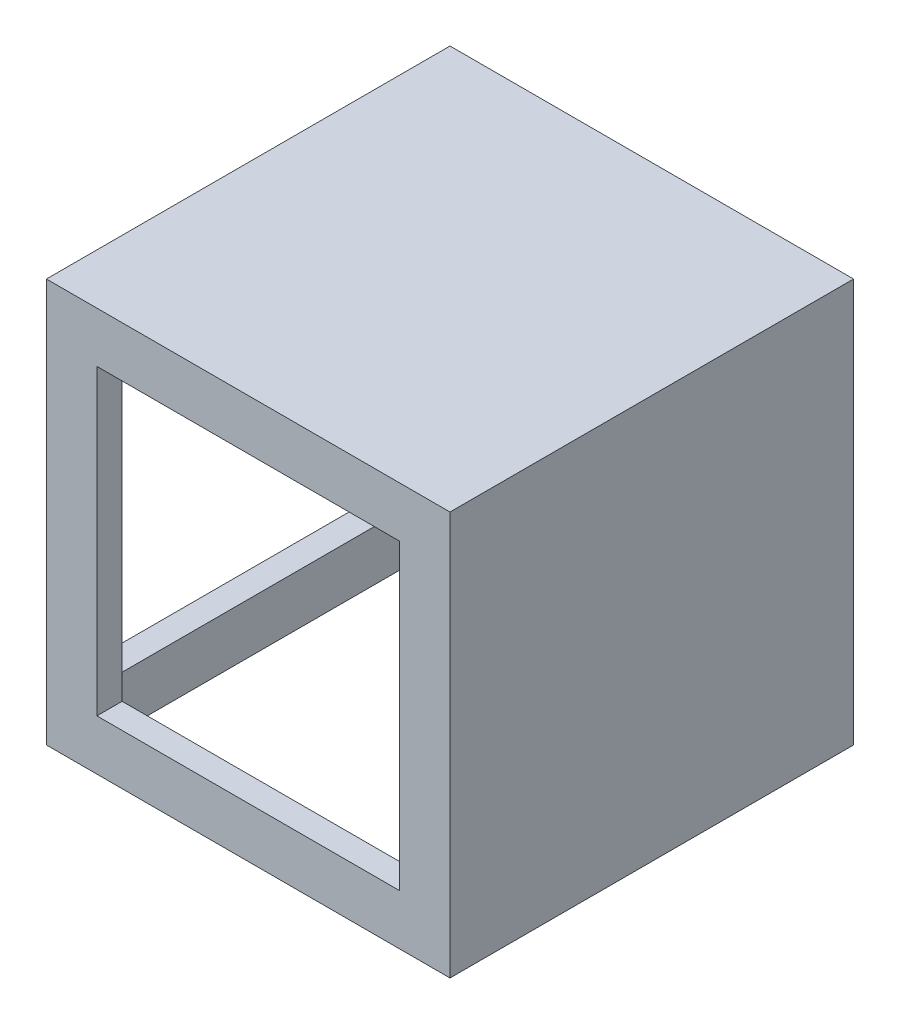
ISO-10303-21;
HEADER;
FILE_DESCRIPTION(('STEP AP214'),'2;1');
FILE_NAME('part.step','',(''),(''),'','','');
FILE_SCHEMA(('AUTOMOTIVE_DESIGN { 1 0 10303 214 1 1 1 1 }'));
ENDSEC;
DATA;
#1=APPLICATION_CONTEXT('core data for automotive mechanical design processes');
#2=APPLICATION_PROTOCOL_DEFINITION('international standard','automotive_design',2000,#1);
#3=PRODUCT_CONTEXT('',#1,'mechanical');
#4=PRODUCT('Part','Part','',(#3));
#5=PRODUCT_RELATED_PRODUCT_CATEGORY('part','',(#4));
#6=PRODUCT_DEFINITION_FORMATION('','',#4);
#7=PRODUCT_DEFINITION_CONTEXT('part definition',#1,'design');
#8=PRODUCT_DEFINITION('design','',#6,#7);
#9=PRODUCT_DEFINITION_SHAPE('','',#8);
#10=(LENGTH_UNIT() NAMED_UNIT(*) SI_UNIT(.MILLI.,.METRE.));
#11=(NAMED_UNIT(*) PLANE_ANGLE_UNIT() SI_UNIT($,.RADIAN.));
#12=(NAMED_UNIT(*) SI_UNIT($,.STERADIAN.) SOLID_ANGLE_UNIT());
#13=UNCERTAINTY_MEASURE_WITH_UNIT(LENGTH_MEASURE(1.E-05),#10,'distance_accuracy_value','');
#14=(GEOMETRIC_REPRESENTATION_CONTEXT(3) GLOBAL_UNCERTAINTY_ASSIGNED_CONTEXT((#13)) GLOBAL_UNIT_ASSIGNED_CONTEXT((#10,
#11,#12)) REPRESENTATION_CONTEXT('',''));
#15=CARTESIAN_POINT('',(0.,0.,0.));
#16=DIRECTION('',(0.,0.,1.));
#17=DIRECTION('',(1.,0.,0.));
#18=AXIS2_PLACEMENT_3D('',#15,#16,#17);
#19=CARTESIAN_POINT('',(16.,0.,16.));
#20=DIRECTION('',(0.,1.,0.));
#21=DIRECTION('',(0.,0.,1.));
#22=AXIS2_PLACEMENT_3D('',#19,#20,#21);
#23=PLANE('',#22);
#24=DIRECTION('',(1.,0.,0.));
#25=VECTOR('',#24,1.);
#26=CARTESIAN_POINT('',(16.,0.,0.));
#27=LINE('',#26,#25);
#28=CARTESIAN_POINT('',(0.,0.,0.));
#29=VERTEX_POINT('',#28);
#30=CARTESIAN_POINT('',(16.,0.,0.));
#31=VERTEX_POINT('',#30);
#32=EDGE_CURVE('E275',#29,#31,#27,.T.);
#33=ORIENTED_EDGE('',*,*,#32,.T.);
#34=DIRECTION('',(0.,0.,-1.));
#35=VECTOR('',#34,1.);
#36=CARTESIAN_POINT('',(16.,0.,16.));
#37=LINE('',#36,#35);
#38=CARTESIAN_POINT('',(16.,0.,16.));
#39=VERTEX_POINT('',#38);
#40=EDGE_CURVE('E308',#39,#31,#37,.T.);
#41=ORIENTED_EDGE('',*,*,#40,.F.);
#42=DIRECTION('',(1.,0.,0.));
#43=VECTOR('',#42,1.);
#44=CARTESIAN_POINT('',(16.,0.,16.));
#45=LINE('',#44,#43);
#46=CARTESIAN_POINT('',(0.,0.,16.));
#47=VERTEX_POINT('',#46);
#48=EDGE_CURVE('E282',#47,#39,#45,.T.);
#49=ORIENTED_EDGE('',*,*,#48,.F.);
#50=DIRECTION('',(0.,0.,-1.));
#51=VECTOR('',#50,1.);
#52=CARTESIAN_POINT('',(0.,0.,16.));
#53=LINE('',#52,#51);
#54=EDGE_CURVE('E292',#47,#29,#53,.T.);
#55=ORIENTED_EDGE('',*,*,#54,.T.);
#56=EDGE_LOOP('',(#33,#41,#49,#55));
#57=FACE_BOUND('',#56,.T.);
#58=DIRECTION('',(1.,0.,0.));
#59=VECTOR('',#58,1.);
#60=CARTESIAN_POINT('',(0.,0.,1.));
#61=LINE('',#60,#59);
#62=CARTESIAN_POINT('',(1.,0.,1.));
#63=VERTEX_POINT('',#62);
#64=CARTESIAN_POINT('',(15.,0.,1.));
#65=VERTEX_POINT('',#64);
#66=EDGE_CURVE('E250',#63,#65,#61,.T.);
#67=ORIENTED_EDGE('',*,*,#66,.F.);
#68=DIRECTION('',(0.,0.,-1.));
#69=VECTOR('',#68,1.);
#70=CARTESIAN_POINT('',(1.,0.,16.));
#71=LINE('',#70,#69);
#72=CARTESIAN_POINT('',(1.,0.,15.));
#73=VERTEX_POINT('',#72);
#74=EDGE_CURVE('E267',#73,#63,#71,.T.);
#75=ORIENTED_EDGE('',*,*,#74,.F.);
#76=DIRECTION('',(1.,0.,0.));
#77=VECTOR('',#76,1.);
#78=CARTESIAN_POINT('',(0.,0.,15.));
#79=LINE('',#78,#77);
#80=CARTESIAN_POINT('',(15.,0.,15.));
#81=VERTEX_POINT('',#80);
#82=EDGE_CURVE('E262',#73,#81,#79,.T.);
#83=ORIENTED_EDGE('',*,*,#82,.T.);
#84=DIRECTION('',(0.,0.,-1.));
#85=VECTOR('',#84,1.);
#86=CARTESIAN_POINT('',(15.,0.,16.));
#87=LINE('',#86,#85);
#88=EDGE_CURVE('E257',#81,#65,#87,.T.);
#89=ORIENTED_EDGE('',*,*,#88,.T.);
#90=EDGE_LOOP('',(#67,#75,#83,#89));
#91=FACE_BOUND('',#90,.T.);
#92=ADVANCED_FACE('F40',(#57,#91),#23,.F.);
#93=CARTESIAN_POINT('',(16.,16.,16.));
#94=DIRECTION('',(-1.,0.,0.));
#95=DIRECTION('',(0.,0.,1.));
#96=AXIS2_PLACEMENT_3D('',#93,#94,#95);
#97=PLANE('',#96);
#98=DIRECTION('',(0.,1.,0.));
#99=VECTOR('',#98,1.);
#100=CARTESIAN_POINT('',(16.,16.,0.));
#101=LINE('',#100,#99);
#102=CARTESIAN_POINT('',(16.,16.,0.));
#103=VERTEX_POINT('',#102);
#104=EDGE_CURVE('E295',#31,#103,#101,.T.);
#105=ORIENTED_EDGE('',*,*,#104,.T.);
#106=DIRECTION('',(0.,0.,-1.));
#107=VECTOR('',#106,1.);
#108=CARTESIAN_POINT('',(16.,16.,16.));
#109=LINE('',#108,#107);
#110=CARTESIAN_POINT('',(16.,16.,16.));
#111=VERTEX_POINT('',#110);
#112=EDGE_CURVE('E305',#111,#103,#109,.T.);
#113=ORIENTED_EDGE('',*,*,#112,.F.);
#114=DIRECTION('',(0.,1.,0.));
#115=VECTOR('',#114,1.);
#116=CARTESIAN_POINT('',(16.,16.,16.));
#117=LINE('',#116,#115);
#118=EDGE_CURVE('E285',#39,#111,#117,.T.);
#119=ORIENTED_EDGE('',*,*,#118,.F.);
#120=ORIENTED_EDGE('',*,*,#40,.T.);
#121=EDGE_LOOP('',(#105,#113,#119,#120));
#122=FACE_BOUND('',#121,.T.);
#123=ADVANCED_FACE('F349',(#122),#97,.F.);
#124=CARTESIAN_POINT('',(0.,16.,16.));
#125=DIRECTION('',(0.,-1.,0.));
#126=DIRECTION('',(0.,0.,-1.));
#127=AXIS2_PLACEMENT_3D('',#124,#125,#126);
#128=PLANE('',#127);
#129=DIRECTION('',(-1.,0.,0.));
#130=VECTOR('',#129,1.);
#131=CARTESIAN_POINT('',(0.,16.,0.));
#132=LINE('',#131,#130);
#133=CARTESIAN_POINT('',(0.,16.,0.));
#134=VERTEX_POINT('',#133);
#135=EDGE_CURVE('E297',#103,#134,#132,.T.);
#136=ORIENTED_EDGE('',*,*,#135,.T.);
#137=DIRECTION('',(0.,0.,-1.));
#138=VECTOR('',#137,1.);
#139=CARTESIAN_POINT('',(0.,16.,16.));
#140=LINE('',#139,#138);
#141=CARTESIAN_POINT('',(0.,16.,16.));
#142=VERTEX_POINT('',#141);
#143=EDGE_CURVE('E302',#142,#134,#140,.T.);
#144=ORIENTED_EDGE('',*,*,#143,.F.);
#145=DIRECTION('',(-1.,0.,0.));
#146=VECTOR('',#145,1.);
#147=CARTESIAN_POINT('',(0.,16.,16.));
#148=LINE('',#147,#146);
#149=EDGE_CURVE('E288',#111,#142,#148,.T.);
#150=ORIENTED_EDGE('',*,*,#149,.F.);
#151=ORIENTED_EDGE('',*,*,#112,.T.);
#152=EDGE_LOOP('',(#136,#144,#150,#151));
#153=FACE_BOUND('',#152,.T.);
#154=ADVANCED_FACE('F354',(#153),#128,.F.);
#155=CARTESIAN_POINT('',(0.,0.,16.));
#156=DIRECTION('',(1.,0.,0.));
#157=DIRECTION('',(0.,0.,-1.));
#158=AXIS2_PLACEMENT_3D('',#155,#156,#157);
#159=PLANE('',#158);
#160=DIRECTION('',(0.,0.,-1.));
#161=VECTOR('',#160,1.);
#162=CARTESIAN_POINT('',(0.,14.,2.));
#163=LINE('',#162,#161);
#164=CARTESIAN_POINT('',(0.,14.,14.));
#165=VERTEX_POINT('',#164);
#166=CARTESIAN_POINT('',(0.,14.,2.));
#167=VERTEX_POINT('',#166);
#168=EDGE_CURVE('E187',#165,#167,#163,.T.);
#169=ORIENTED_EDGE('',*,*,#168,.F.);
#170=DIRECTION('',(0.,1.,0.));
#171=VECTOR('',#170,1.);
#172=CARTESIAN_POINT('',(0.,14.,14.));
#173=LINE('',#172,#171);
#174=CARTESIAN_POINT('',(0.,2.,14.));
#175=VERTEX_POINT('',#174);
#176=EDGE_CURVE('E54',#175,#165,#173,.T.);
#177=ORIENTED_EDGE('',*,*,#176,.F.);
#178=DIRECTION('',(0.,0.,1.));
#179=VECTOR('',#178,1.);
#180=CARTESIAN_POINT('',(0.,2.,2.));
#181=LINE('',#180,#179);
#182=CARTESIAN_POINT('',(0.,2.,2.));
#183=VERTEX_POINT('',#182);
#184=EDGE_CURVE('E194',#183,#175,#181,.T.);
#185=ORIENTED_EDGE('',*,*,#184,.F.);
#186=DIRECTION('',(0.,-1.,0.));
#187=VECTOR('',#186,1.);
#188=CARTESIAN_POINT('',(0.,14.,2.));
#189=LINE('',#188,#187);
#190=EDGE_CURVE('E178',#167,#183,#189,.T.);
#191=ORIENTED_EDGE('',*,*,#190,.F.);
#192=EDGE_LOOP('',(#169,#177,#185,#191));
#193=FACE_BOUND('',#192,.T.);
#194=DIRECTION('',(0.,-1.,0.));
#195=VECTOR('',#194,1.);
#196=CARTESIAN_POINT('',(0.,0.,0.));
#197=LINE('',#196,#195);
#198=EDGE_CURVE('E286',#134,#29,#197,.T.);
#199=ORIENTED_EDGE('',*,*,#198,.T.);
#200=ORIENTED_EDGE('',*,*,#54,.F.);
#201=DIRECTION('',(0.,-1.,0.));
#202=VECTOR('',#201,1.);
#203=CARTESIAN_POINT('',(0.,0.,16.));
#204=LINE('',#203,#202);
#205=EDGE_CURVE('E290',#142,#47,#204,.T.);
#206=ORIENTED_EDGE('',*,*,#205,.F.);
#207=ORIENTED_EDGE('',*,*,#143,.T.);
#208=EDGE_LOOP('',(#199,#200,#206,#207));
#209=FACE_BOUND('',#208,.T.);
#210=ADVANCED_FACE('F191',(#193,#209),#159,.F.);
#211=CARTESIAN_POINT('',(0.,0.,16.));
#212=DIRECTION('',(0.,0.,-1.));
#213=DIRECTION('',(-1.,0.,0.));
#214=AXIS2_PLACEMENT_3D('',#211,#212,#213);
#215=PLANE('',#214);
#216=DIRECTION('',(-1.,0.,0.));
#217=VECTOR('',#216,1.);
#218=CARTESIAN_POINT('',(14.,2.,16.));
#219=LINE('',#218,#217);
#220=CARTESIAN_POINT('',(14.,2.,16.));
#221=VERTEX_POINT('',#220);
#222=CARTESIAN_POINT('',(2.,2.,16.));
#223=VERTEX_POINT('',#222);
#224=EDGE_CURVE('E214',#221,#223,#219,.T.);
#225=ORIENTED_EDGE('',*,*,#224,.T.);
#226=DIRECTION('',(0.,1.,0.));
#227=VECTOR('',#226,1.);
#228=CARTESIAN_POINT('',(2.,14.,16.));
#229=LINE('',#228,#227);
#230=CARTESIAN_POINT('',(2.,14.,16.));
#231=VERTEX_POINT('',#230);
#232=EDGE_CURVE('E204',#223,#231,#229,.T.);
#233=ORIENTED_EDGE('',*,*,#232,.T.);
#234=DIRECTION('',(1.,0.,0.));
#235=VECTOR('',#234,1.);
#236=CARTESIAN_POINT('',(14.,14.,16.));
#237=LINE('',#236,#235);
#238=CARTESIAN_POINT('',(14.,14.,16.));
#239=VERTEX_POINT('',#238);
#240=EDGE_CURVE('E207',#231,#239,#237,.T.);
#241=ORIENTED_EDGE('',*,*,#240,.T.);
#242=DIRECTION('',(0.,-1.,0.));
#243=VECTOR('',#242,1.);
#244=CARTESIAN_POINT('',(14.,14.,16.));
#245=LINE('',#244,#243);
#246=EDGE_CURVE('E211',#239,#221,#245,.T.);
#247=ORIENTED_EDGE('',*,*,#246,.T.);
#248=EDGE_LOOP('',(#225,#233,#241,#247));
#249=FACE_BOUND('',#248,.T.);
#250=ORIENTED_EDGE('',*,*,#48,.T.);
#251=ORIENTED_EDGE('',*,*,#118,.T.);
#252=ORIENTED_EDGE('',*,*,#149,.T.);
#253=ORIENTED_EDGE('',*,*,#205,.T.);
#254=EDGE_LOOP('',(#250,#251,#252,#253));
#255=FACE_BOUND('',#254,.T.);
#256=ADVANCED_FACE('F393',(#249,#255),#215,.F.);
#257=CARTESIAN_POINT('',(0.,0.,0.));
#258=DIRECTION('',(0.,0.,-1.));
#259=DIRECTION('',(-1.,0.,0.));
#260=AXIS2_PLACEMENT_3D('',#257,#258,#259);
#261=PLANE('',#260);
#262=DIRECTION('',(0.,1.,0.));
#263=VECTOR('',#262,1.);
#264=CARTESIAN_POINT('',(2.,14.,0.));
#265=LINE('',#264,#263);
#266=CARTESIAN_POINT('',(2.,2.,0.));
#267=VERTEX_POINT('',#266);
#268=CARTESIAN_POINT('',(2.,14.,0.));
#269=VERTEX_POINT('',#268);
#270=EDGE_CURVE('E201',#267,#269,#265,.T.);
#271=ORIENTED_EDGE('',*,*,#270,.F.);
#272=DIRECTION('',(-1.,0.,0.));
#273=VECTOR('',#272,1.);
#274=CARTESIAN_POINT('',(14.,2.,0.));
#275=LINE('',#274,#273);
#276=CARTESIAN_POINT('',(14.,2.,0.));
#277=VERTEX_POINT('',#276);
#278=EDGE_CURVE('E208',#277,#267,#275,.T.);
#279=ORIENTED_EDGE('',*,*,#278,.F.);
#280=DIRECTION('',(0.,-1.,0.));
#281=VECTOR('',#280,1.);
#282=CARTESIAN_POINT('',(14.,14.,0.));
#283=LINE('',#282,#281);
#284=CARTESIAN_POINT('',(14.,14.,0.));
#285=VERTEX_POINT('',#284);
#286=EDGE_CURVE('E222',#285,#277,#283,.T.);
#287=ORIENTED_EDGE('',*,*,#286,.F.);
#288=DIRECTION('',(1.,0.,0.));
#289=VECTOR('',#288,1.);
#290=CARTESIAN_POINT('',(14.,14.,0.));
#291=LINE('',#290,#289);
#292=EDGE_CURVE('E219',#269,#285,#291,.T.);
#293=ORIENTED_EDGE('',*,*,#292,.F.);
#294=EDGE_LOOP('',(#271,#279,#287,#293));
#295=FACE_BOUND('',#294,.T.);
#296=ORIENTED_EDGE('',*,*,#32,.F.);
#297=ORIENTED_EDGE('',*,*,#198,.F.);
#298=ORIENTED_EDGE('',*,*,#135,.F.);
#299=ORIENTED_EDGE('',*,*,#104,.F.);
#300=EDGE_LOOP('',(#296,#297,#298,#299));
#301=FACE_BOUND('',#300,.T.);
#302=ADVANCED_FACE('F383',(#295,#301),#261,.T.);
#303=CARTESIAN_POINT('',(15.,16.,16.));
#304=DIRECTION('',(-1.,0.,0.));
#305=DIRECTION('',(0.,0.,1.));
#306=AXIS2_PLACEMENT_3D('',#303,#304,#305);
#307=PLANE('',#306);
#308=DIRECTION('',(0.,1.,0.));
#309=VECTOR('',#308,1.);
#310=CARTESIAN_POINT('',(15.,0.,1.));
#311=LINE('',#310,#309);
#312=CARTESIAN_POINT('',(15.,15.,1.));
#313=VERTEX_POINT('',#312);
#314=EDGE_CURVE('E251',#65,#313,#311,.T.);
#315=ORIENTED_EDGE('',*,*,#314,.F.);
#316=ORIENTED_EDGE('',*,*,#88,.F.);
#317=DIRECTION('',(0.,1.,0.));
#318=VECTOR('',#317,1.);
#319=CARTESIAN_POINT('',(15.,0.,15.));
#320=LINE('',#319,#318);
#321=CARTESIAN_POINT('',(15.,15.,15.));
#322=VERTEX_POINT('',#321);
#323=EDGE_CURVE('E259',#81,#322,#320,.T.);
#324=ORIENTED_EDGE('',*,*,#323,.T.);
#325=DIRECTION('',(0.,0.,-1.));
#326=VECTOR('',#325,1.);
#327=CARTESIAN_POINT('',(15.,15.,16.));
#328=LINE('',#327,#326);
#329=EDGE_CURVE('E254',#322,#313,#328,.T.);
#330=ORIENTED_EDGE('',*,*,#329,.T.);
#331=EDGE_LOOP('',(#315,#316,#324,#330));
#332=FACE_BOUND('',#331,.T.);
#333=ADVANCED_FACE('F373',(#332),#307,.T.);
#334=CARTESIAN_POINT('',(0.,15.,16.));
#335=DIRECTION('',(0.,-1.,0.));
#336=DIRECTION('',(0.,0.,-1.));
#337=AXIS2_PLACEMENT_3D('',#334,#335,#336);
#338=PLANE('',#337);
#339=DIRECTION('',(-1.,0.,0.));
#340=VECTOR('',#339,1.);
#341=CARTESIAN_POINT('',(0.,15.,1.));
#342=LINE('',#341,#340);
#343=CARTESIAN_POINT('',(1.,15.,1.));
#344=VERTEX_POINT('',#343);
#345=EDGE_CURVE('E253',#313,#344,#342,.T.);
#346=ORIENTED_EDGE('',*,*,#345,.F.);
#347=ORIENTED_EDGE('',*,*,#329,.F.);
#348=DIRECTION('',(-1.,0.,0.));
#349=VECTOR('',#348,1.);
#350=CARTESIAN_POINT('',(0.,15.,15.));
#351=LINE('',#350,#349);
#352=CARTESIAN_POINT('',(1.,15.,15.));
#353=VERTEX_POINT('',#352);
#354=EDGE_CURVE('E261',#322,#353,#351,.T.);
#355=ORIENTED_EDGE('',*,*,#354,.T.);
#356=DIRECTION('',(0.,0.,-1.));
#357=VECTOR('',#356,1.);
#358=CARTESIAN_POINT('',(1.,15.,16.));
#359=LINE('',#358,#357);
#360=EDGE_CURVE('E258',#353,#344,#359,.T.);
#361=ORIENTED_EDGE('',*,*,#360,.T.);
#362=EDGE_LOOP('',(#346,#347,#355,#361));
#363=FACE_BOUND('',#362,.T.);
#364=ADVANCED_FACE('F375',(#363),#338,.T.);
#365=CARTESIAN_POINT('',(1.,0.,16.));
#366=DIRECTION('',(1.,0.,0.));
#367=DIRECTION('',(0.,0.,-1.));
#368=AXIS2_PLACEMENT_3D('',#365,#366,#367);
#369=PLANE('',#368);
#370=DIRECTION('',(0.,-1.,0.));
#371=VECTOR('',#370,1.);
#372=CARTESIAN_POINT('',(1.,0.,14.));
#373=LINE('',#372,#371);
#374=CARTESIAN_POINT('',(1.,14.,14.));
#375=VERTEX_POINT('',#374);
#376=CARTESIAN_POINT('',(1.,2.,14.));
#377=VERTEX_POINT('',#376);
#378=EDGE_CURVE('E11',#375,#377,#373,.T.);
#379=ORIENTED_EDGE('',*,*,#378,.F.);
#380=DIRECTION('',(0.,0.,1.));
#381=VECTOR('',#380,1.);
#382=CARTESIAN_POINT('',(1.,14.,16.));
#383=LINE('',#382,#381);
#384=CARTESIAN_POINT('',(1.,14.,2.));
#385=VERTEX_POINT('',#384);
#386=EDGE_CURVE('E323',#385,#375,#383,.T.);
#387=ORIENTED_EDGE('',*,*,#386,.F.);
#388=DIRECTION('',(0.,1.,0.));
#389=VECTOR('',#388,1.);
#390=CARTESIAN_POINT('',(1.,0.,2.));
#391=LINE('',#390,#389);
#392=CARTESIAN_POINT('',(1.,2.,2.));
#393=VERTEX_POINT('',#392);
#394=EDGE_CURVE('E181',#393,#385,#391,.T.);
#395=ORIENTED_EDGE('',*,*,#394,.F.);
#396=DIRECTION('',(0.,0.,-1.));
#397=VECTOR('',#396,1.);
#398=CARTESIAN_POINT('',(1.,2.,16.));
#399=LINE('',#398,#397);
#400=EDGE_CURVE('E47',#377,#393,#399,.T.);
#401=ORIENTED_EDGE('',*,*,#400,.F.);
#402=EDGE_LOOP('',(#379,#387,#395,#401));
#403=FACE_BOUND('',#402,.T.);
#404=DIRECTION('',(0.,-1.,0.));
#405=VECTOR('',#404,1.);
#406=CARTESIAN_POINT('',(1.,0.,1.));
#407=LINE('',#406,#405);
#408=EDGE_CURVE('E264',#344,#63,#407,.T.);
#409=ORIENTED_EDGE('',*,*,#408,.F.);
#410=ORIENTED_EDGE('',*,*,#360,.F.);
#411=DIRECTION('',(0.,-1.,0.));
#412=VECTOR('',#411,1.);
#413=CARTESIAN_POINT('',(1.,0.,15.));
#414=LINE('',#413,#412);
#415=EDGE_CURVE('E269',#353,#73,#414,.T.);
#416=ORIENTED_EDGE('',*,*,#415,.T.);
#417=ORIENTED_EDGE('',*,*,#74,.T.);
#418=EDGE_LOOP('',(#409,#410,#416,#417));
#419=FACE_BOUND('',#418,.T.);
#420=ADVANCED_FACE('F331',(#403,#419),#369,.T.);
#421=CARTESIAN_POINT('',(0.,0.,15.));
#422=DIRECTION('',(0.,0.,-1.));
#423=DIRECTION('',(-1.,0.,0.));
#424=AXIS2_PLACEMENT_3D('',#421,#422,#423);
#425=PLANE('',#424);
#426=DIRECTION('',(0.,1.,0.));
#427=VECTOR('',#426,1.);
#428=CARTESIAN_POINT('',(2.,0.,15.));
#429=LINE('',#428,#427);
#430=CARTESIAN_POINT('',(2.,2.,15.));
#431=VERTEX_POINT('',#430);
#432=CARTESIAN_POINT('',(2.,14.,15.));
#433=VERTEX_POINT('',#432);
#434=EDGE_CURVE('E247',#431,#433,#429,.T.);
#435=ORIENTED_EDGE('',*,*,#434,.F.);
#436=DIRECTION('',(-1.,0.,0.));
#437=VECTOR('',#436,1.);
#438=CARTESIAN_POINT('',(0.,2.,15.));
#439=LINE('',#438,#437);
#440=CARTESIAN_POINT('',(14.,2.,15.));
#441=VERTEX_POINT('',#440);
#442=EDGE_CURVE('E245',#441,#431,#439,.T.);
#443=ORIENTED_EDGE('',*,*,#442,.F.);
#444=DIRECTION('',(0.,-1.,0.));
#445=VECTOR('',#444,1.);
#446=CARTESIAN_POINT('',(14.,0.,15.));
#447=LINE('',#446,#445);
#448=CARTESIAN_POINT('',(14.,14.,15.));
#449=VERTEX_POINT('',#448);
#450=EDGE_CURVE('E243',#449,#441,#447,.T.);
#451=ORIENTED_EDGE('',*,*,#450,.F.);
#452=DIRECTION('',(1.,0.,0.));
#453=VECTOR('',#452,1.);
#454=CARTESIAN_POINT('',(0.,14.,15.));
#455=LINE('',#454,#453);
#456=EDGE_CURVE('E230',#433,#449,#455,.T.);
#457=ORIENTED_EDGE('',*,*,#456,.F.);
#458=EDGE_LOOP('',(#435,#443,#451,#457));
#459=FACE_BOUND('',#458,.T.);
#460=ORIENTED_EDGE('',*,*,#82,.F.);
#461=ORIENTED_EDGE('',*,*,#415,.F.);
#462=ORIENTED_EDGE('',*,*,#354,.F.);
#463=ORIENTED_EDGE('',*,*,#323,.F.);
#464=EDGE_LOOP('',(#460,#461,#462,#463));
#465=FACE_BOUND('',#464,.T.);
#466=ADVANCED_FACE('F370',(#459,#465),#425,.T.);
#467=CARTESIAN_POINT('',(0.,0.,1.));
#468=DIRECTION('',(0.,0.,-1.));
#469=DIRECTION('',(-1.,0.,0.));
#470=AXIS2_PLACEMENT_3D('',#467,#468,#469);
#471=PLANE('',#470);
#472=DIRECTION('',(-1.,0.,0.));
#473=VECTOR('',#472,1.);
#474=CARTESIAN_POINT('',(0.,2.,1.));
#475=LINE('',#474,#473);
#476=CARTESIAN_POINT('',(14.,2.,1.));
#477=VERTEX_POINT('',#476);
#478=CARTESIAN_POINT('',(2.,2.,1.));
#479=VERTEX_POINT('',#478);
#480=EDGE_CURVE('E317',#477,#479,#475,.T.);
#481=ORIENTED_EDGE('',*,*,#480,.T.);
#482=DIRECTION('',(0.,1.,0.));
#483=VECTOR('',#482,1.);
#484=CARTESIAN_POINT('',(2.,0.,1.));
#485=LINE('',#484,#483);
#486=CARTESIAN_POINT('',(2.,14.,1.));
#487=VERTEX_POINT('',#486);
#488=EDGE_CURVE('E320',#479,#487,#485,.T.);
#489=ORIENTED_EDGE('',*,*,#488,.T.);
#490=DIRECTION('',(1.,0.,0.));
#491=VECTOR('',#490,1.);
#492=CARTESIAN_POINT('',(0.,14.,1.));
#493=LINE('',#492,#491);
#494=CARTESIAN_POINT('',(14.,14.,1.));
#495=VERTEX_POINT('',#494);
#496=EDGE_CURVE('E311',#487,#495,#493,.T.);
#497=ORIENTED_EDGE('',*,*,#496,.T.);
#498=DIRECTION('',(0.,-1.,0.));
#499=VECTOR('',#498,1.);
#500=CARTESIAN_POINT('',(14.,0.,1.));
#501=LINE('',#500,#499);
#502=EDGE_CURVE('E314',#495,#477,#501,.T.);
#503=ORIENTED_EDGE('',*,*,#502,.T.);
#504=EDGE_LOOP('',(#481,#489,#497,#503));
#505=FACE_BOUND('',#504,.T.);
#506=ORIENTED_EDGE('',*,*,#66,.T.);
#507=ORIENTED_EDGE('',*,*,#314,.T.);
#508=ORIENTED_EDGE('',*,*,#345,.T.);
#509=ORIENTED_EDGE('',*,*,#408,.T.);
#510=EDGE_LOOP('',(#506,#507,#508,#509));
#511=FACE_BOUND('',#510,.T.);
#512=ADVANCED_FACE('F363',(#505,#511),#471,.F.);
#513=CARTESIAN_POINT('',(14.,14.,16.));
#514=DIRECTION('',(0.,1.,0.));
#515=DIRECTION('',(0.,0.,1.));
#516=AXIS2_PLACEMENT_3D('',#513,#514,#515);
#517=PLANE('',#516);
#518=DIRECTION('',(0.,0.,-1.));
#519=VECTOR('',#518,1.);
#520=CARTESIAN_POINT('',(2.,14.,16.));
#521=LINE('',#520,#519);
#522=EDGE_CURVE('E217',#487,#269,#521,.T.);
#523=ORIENTED_EDGE('',*,*,#522,.T.);
#524=ORIENTED_EDGE('',*,*,#292,.T.);
#525=DIRECTION('',(0.,0.,-1.));
#526=VECTOR('',#525,1.);
#527=CARTESIAN_POINT('',(14.,14.,16.));
#528=LINE('',#527,#526);
#529=EDGE_CURVE('E239',#495,#285,#528,.T.);
#530=ORIENTED_EDGE('',*,*,#529,.F.);
#531=ORIENTED_EDGE('',*,*,#496,.F.);
#532=EDGE_LOOP('',(#523,#524,#530,#531));
#533=FACE_BOUND('',#532,.T.);
#534=ADVANCED_FACE('F345',(#533),#517,.F.);
#535=CARTESIAN_POINT('',(14.,14.,16.));
#536=DIRECTION('',(1.,0.,0.));
#537=DIRECTION('',(0.,1.,0.));
#538=AXIS2_PLACEMENT_3D('',#535,#536,#537);
#539=PLANE('',#538);
#540=ORIENTED_EDGE('',*,*,#529,.T.);
#541=ORIENTED_EDGE('',*,*,#286,.T.);
#542=DIRECTION('',(0.,0.,-1.));
#543=VECTOR('',#542,1.);
#544=CARTESIAN_POINT('',(14.,2.,16.));
#545=LINE('',#544,#543);
#546=EDGE_CURVE('E235',#477,#277,#545,.T.);
#547=ORIENTED_EDGE('',*,*,#546,.F.);
#548=ORIENTED_EDGE('',*,*,#502,.F.);
#549=EDGE_LOOP('',(#540,#541,#547,#548));
#550=FACE_BOUND('',#549,.T.);
#551=ADVANCED_FACE('F478',(#550),#539,.F.);
#552=CARTESIAN_POINT('',(14.,2.,16.));
#553=DIRECTION('',(0.,-1.,0.));
#554=DIRECTION('',(1.,0.,0.));
#555=AXIS2_PLACEMENT_3D('',#552,#553,#554);
#556=PLANE('',#555);
#557=ORIENTED_EDGE('',*,*,#546,.T.);
#558=ORIENTED_EDGE('',*,*,#278,.T.);
#559=DIRECTION('',(0.,0.,-1.));
#560=VECTOR('',#559,1.);
#561=CARTESIAN_POINT('',(2.,2.,16.));
#562=LINE('',#561,#560);
#563=EDGE_CURVE('E231',#479,#267,#562,.T.);
#564=ORIENTED_EDGE('',*,*,#563,.F.);
#565=ORIENTED_EDGE('',*,*,#480,.F.);
#566=EDGE_LOOP('',(#557,#558,#564,#565));
#567=FACE_BOUND('',#566,.T.);
#568=ADVANCED_FACE('F488',(#567),#556,.F.);
#569=CARTESIAN_POINT('',(2.,14.,16.));
#570=DIRECTION('',(-1.,0.,0.));
#571=DIRECTION('',(0.,-1.,0.));
#572=AXIS2_PLACEMENT_3D('',#569,#570,#571);
#573=PLANE('',#572);
#574=ORIENTED_EDGE('',*,*,#563,.T.);
#575=ORIENTED_EDGE('',*,*,#270,.T.);
#576=ORIENTED_EDGE('',*,*,#522,.F.);
#577=ORIENTED_EDGE('',*,*,#488,.F.);
#578=EDGE_LOOP('',(#574,#575,#576,#577));
#579=FACE_BOUND('',#578,.T.);
#580=ADVANCED_FACE('F499',(#579),#573,.F.);
#581=ORIENTED_EDGE('',*,*,#434,.T.);
#582=EDGE_CURVE('E240',#231,#433,#521,.T.);
#583=ORIENTED_EDGE('',*,*,#582,.F.);
#584=ORIENTED_EDGE('',*,*,#232,.F.);
#585=EDGE_CURVE('E227',#223,#431,#562,.T.);
#586=ORIENTED_EDGE('',*,*,#585,.T.);
#587=EDGE_LOOP('',(#581,#583,#584,#586));
#588=FACE_BOUND('',#587,.T.);
#589=ADVANCED_FACE('F510',(#588),#573,.F.);
#590=ORIENTED_EDGE('',*,*,#442,.T.);
#591=ORIENTED_EDGE('',*,*,#585,.F.);
#592=ORIENTED_EDGE('',*,*,#224,.F.);
#593=EDGE_CURVE('E232',#221,#441,#545,.T.);
#594=ORIENTED_EDGE('',*,*,#593,.T.);
#595=EDGE_LOOP('',(#590,#591,#592,#594));
#596=FACE_BOUND('',#595,.T.);
#597=ADVANCED_FACE('F501',(#596),#556,.F.);
#598=ORIENTED_EDGE('',*,*,#450,.T.);
#599=ORIENTED_EDGE('',*,*,#593,.F.);
#600=ORIENTED_EDGE('',*,*,#246,.F.);
#601=EDGE_CURVE('E236',#239,#449,#528,.T.);
#602=ORIENTED_EDGE('',*,*,#601,.T.);
#603=EDGE_LOOP('',(#598,#599,#600,#602));
#604=FACE_BOUND('',#603,.T.);
#605=ADVANCED_FACE('F342',(#604),#539,.F.);
#606=ORIENTED_EDGE('',*,*,#456,.T.);
#607=ORIENTED_EDGE('',*,*,#601,.F.);
#608=ORIENTED_EDGE('',*,*,#240,.F.);
#609=ORIENTED_EDGE('',*,*,#582,.T.);
#610=EDGE_LOOP('',(#606,#607,#608,#609));
#611=FACE_BOUND('',#610,.T.);
#612=ADVANCED_FACE('F335',(#611),#517,.F.);
#613=CARTESIAN_POINT('',(7.,14.,14.));
#614=DIRECTION('',(0.,0.,1.));
#615=DIRECTION('',(0.,-1.,0.));
#616=AXIS2_PLACEMENT_3D('',#613,#614,#615);
#617=PLANE('',#616);
#618=ORIENTED_EDGE('',*,*,#378,.T.);
#619=DIRECTION('',(-1.,0.,0.));
#620=VECTOR('',#619,1.);
#621=CARTESIAN_POINT('',(7.,2.,14.));
#622=LINE('',#621,#620);
#623=EDGE_CURVE('E199',#377,#175,#622,.T.);
#624=ORIENTED_EDGE('',*,*,#623,.T.);
#625=ORIENTED_EDGE('',*,*,#176,.T.);
#626=DIRECTION('',(-1.,0.,0.));
#627=VECTOR('',#626,1.);
#628=CARTESIAN_POINT('',(7.,14.,14.));
#629=LINE('',#628,#627);
#630=EDGE_CURVE('E184',#375,#165,#629,.T.);
#631=ORIENTED_EDGE('',*,*,#630,.F.);
#632=EDGE_LOOP('',(#618,#624,#625,#631));
#633=FACE_BOUND('',#632,.T.);
#634=ADVANCED_FACE('F333',(#633),#617,.F.);
#635=CARTESIAN_POINT('',(7.,2.,2.));
#636=DIRECTION('',(0.,-1.,0.));
#637=DIRECTION('',(0.,0.,-1.));
#638=AXIS2_PLACEMENT_3D('',#635,#636,#637);
#639=PLANE('',#638);
#640=ORIENTED_EDGE('',*,*,#400,.T.);
#641=DIRECTION('',(-1.,0.,0.));
#642=VECTOR('',#641,1.);
#643=CARTESIAN_POINT('',(7.,2.,2.));
#644=LINE('',#643,#642);
#645=EDGE_CURVE('E183',#393,#183,#644,.T.);
#646=ORIENTED_EDGE('',*,*,#645,.T.);
#647=ORIENTED_EDGE('',*,*,#184,.T.);
#648=ORIENTED_EDGE('',*,*,#623,.F.);
#649=EDGE_LOOP('',(#640,#646,#647,#648));
#650=FACE_BOUND('',#649,.T.);
#651=ADVANCED_FACE('F328',(#650),#639,.F.);
#652=CARTESIAN_POINT('',(7.,14.,2.));
#653=DIRECTION('',(0.,0.,-1.));
#654=DIRECTION('',(0.,1.,0.));
#655=AXIS2_PLACEMENT_3D('',#652,#653,#654);
#656=PLANE('',#655);
#657=ORIENTED_EDGE('',*,*,#394,.T.);
#658=DIRECTION('',(-1.,0.,0.));
#659=VECTOR('',#658,1.);
#660=CARTESIAN_POINT('',(7.,14.,2.));
#661=LINE('',#660,#659);
#662=EDGE_CURVE('E62',#385,#167,#661,.T.);
#663=ORIENTED_EDGE('',*,*,#662,.T.);
#664=ORIENTED_EDGE('',*,*,#190,.T.);
#665=ORIENTED_EDGE('',*,*,#645,.F.);
#666=EDGE_LOOP('',(#657,#663,#664,#665));
#667=FACE_BOUND('',#666,.T.);
#668=ADVANCED_FACE('F175',(#667),#656,.F.);
#669=CARTESIAN_POINT('',(7.,14.,2.));
#670=DIRECTION('',(0.,1.,0.));
#671=DIRECTION('',(0.,0.,1.));
#672=AXIS2_PLACEMENT_3D('',#669,#670,#671);
#673=PLANE('',#672);
#674=ORIENTED_EDGE('',*,*,#386,.T.);
#675=ORIENTED_EDGE('',*,*,#630,.T.);
#676=ORIENTED_EDGE('',*,*,#168,.T.);
#677=ORIENTED_EDGE('',*,*,#662,.F.);
#678=EDGE_LOOP('',(#674,#675,#676,#677));
#679=FACE_BOUND('',#678,.T.);
#680=ADVANCED_FACE('F188',(#679),#673,.F.);
#681=CLOSED_SHELL('',(#92,#123,#154,#210,#256,#302,#333,#364,#420,#466,#512,#534,#551,#568,#580,
#589,#597,#605,#612,#634,#651,#668,#680));
#682=MANIFOLD_SOLID_BREP('B2',#681);
#683=ADVANCED_BREP_SHAPE_REPRESENTATION('',(#18,#682),#14);
#684=SHAPE_DEFINITION_REPRESENTATION(#9,#683);
ENDSEC;
END-ISO-10303-21;
